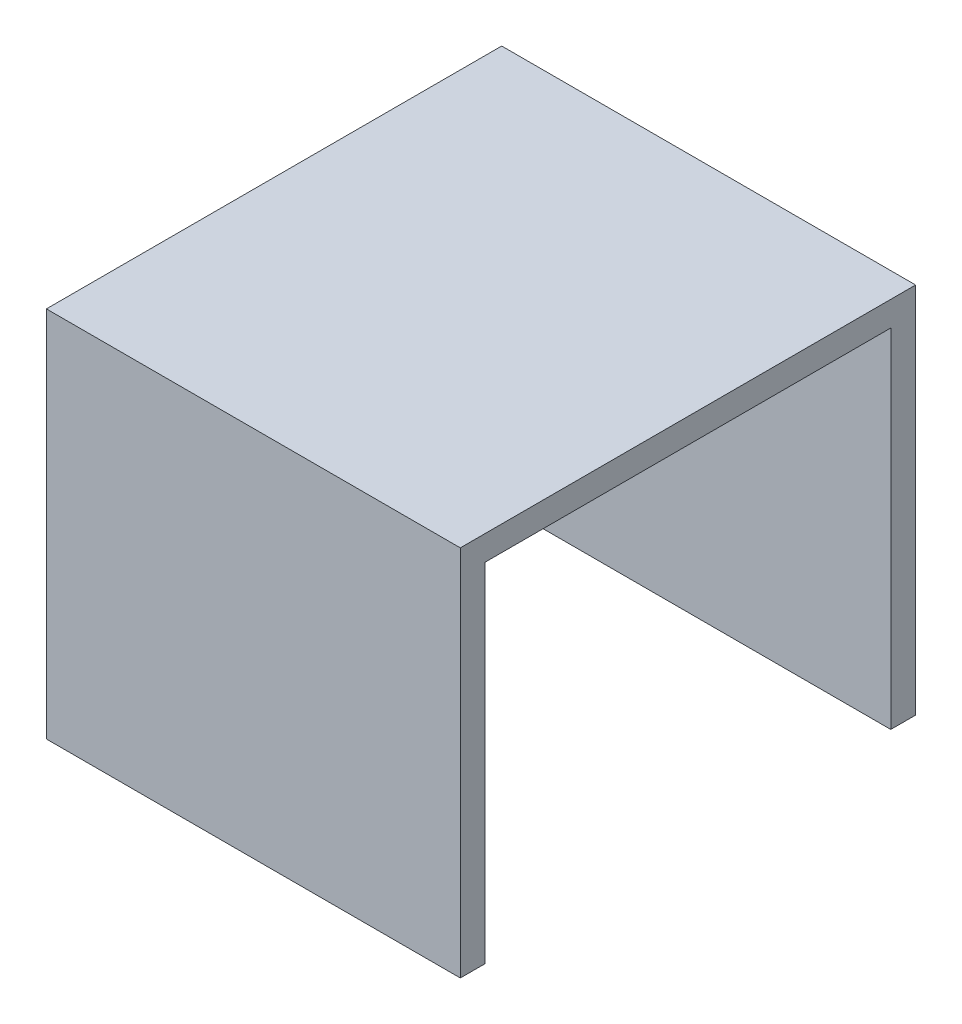
ISO-10303-21;
HEADER;
FILE_DESCRIPTION(('STEP AP214'),'2;1');
FILE_NAME('part.step','',(''),(''),'','','');
FILE_SCHEMA(('AUTOMOTIVE_DESIGN { 1 0 10303 214 1 1 1 1 }'));
ENDSEC;
DATA;
#1=APPLICATION_CONTEXT('core data for automotive mechanical design processes');
#2=APPLICATION_PROTOCOL_DEFINITION('international standard','automotive_design',2000,#1);
#3=PRODUCT_CONTEXT('',#1,'mechanical');
#4=PRODUCT('Part','Part','',(#3));
#5=PRODUCT_RELATED_PRODUCT_CATEGORY('part','',(#4));
#6=PRODUCT_DEFINITION_FORMATION('','',#4);
#7=PRODUCT_DEFINITION_CONTEXT('part definition',#1,'design');
#8=PRODUCT_DEFINITION('design','',#6,#7);
#9=PRODUCT_DEFINITION_SHAPE('','',#8);
#10=(LENGTH_UNIT() NAMED_UNIT(*) SI_UNIT(.MILLI.,.METRE.));
#11=(NAMED_UNIT(*) PLANE_ANGLE_UNIT() SI_UNIT($,.RADIAN.));
#12=(NAMED_UNIT(*) SI_UNIT($,.STERADIAN.) SOLID_ANGLE_UNIT());
#13=UNCERTAINTY_MEASURE_WITH_UNIT(LENGTH_MEASURE(1.E-05),#10,'distance_accuracy_value','');
#14=(GEOMETRIC_REPRESENTATION_CONTEXT(3) GLOBAL_UNCERTAINTY_ASSIGNED_CONTEXT((#13)) GLOBAL_UNIT_ASSIGNED_CONTEXT((#10,
#11,#12)) REPRESENTATION_CONTEXT('',''));
#15=CARTESIAN_POINT('',(0.,0.,0.));
#16=DIRECTION('',(0.,0.,1.));
#17=DIRECTION('',(1.,0.,0.));
#18=AXIS2_PLACEMENT_3D('',#15,#16,#17);
#19=CARTESIAN_POINT('',(1.95,1.695,0.));
#20=DIRECTION('',(0.,1.,0.));
#21=DIRECTION('',(0.707106781186548,0.,0.707106781186548));
#22=AXIS2_PLACEMENT_3D('',#19,#20,#21);
#23=PLANE('',#22);
#24=DIRECTION('',(-1.,0.,0.));
#25=VECTOR('',#24,1.);
#26=CARTESIAN_POINT('',(1.95,1.695,0.03));
#27=LINE('',#26,#25);
#28=CARTESIAN_POINT('',(1.95,1.695,0.03));
#29=VERTEX_POINT('',#28);
#30=CARTESIAN_POINT('',(1.45,1.695,0.03));
#31=VERTEX_POINT('',#30);
#32=EDGE_CURVE('E34',#29,#31,#27,.T.);
#33=ORIENTED_EDGE('',*,*,#32,.F.);
#34=DIRECTION('',(0.,0.,1.));
#35=VECTOR('',#34,1.);
#36=CARTESIAN_POINT('',(1.95,1.695,0.03));
#37=LINE('',#36,#35);
#38=CARTESIAN_POINT('',(1.95,1.695,0.52));
#39=VERTEX_POINT('',#38);
#40=EDGE_CURVE('E11',#29,#39,#37,.T.);
#41=ORIENTED_EDGE('',*,*,#40,.T.);
#42=DIRECTION('',(-1.,0.,0.));
#43=VECTOR('',#42,1.);
#44=CARTESIAN_POINT('',(1.95,1.695,0.52));
#45=LINE('',#44,#43);
#46=CARTESIAN_POINT('',(1.45,1.695,0.52));
#47=VERTEX_POINT('',#46);
#48=EDGE_CURVE('E26',#39,#47,#45,.T.);
#49=ORIENTED_EDGE('',*,*,#48,.T.);
#50=DIRECTION('',(0.,0.,1.));
#51=VECTOR('',#50,1.);
#52=CARTESIAN_POINT('',(1.45,1.695,0.03));
#53=LINE('',#52,#51);
#54=EDGE_CURVE('E124',#31,#47,#53,.T.);
#55=ORIENTED_EDGE('',*,*,#54,.F.);
#56=EDGE_LOOP('',(#33,#41,#49,#55));
#57=FACE_BOUND('',#56,.T.);
#58=ADVANCED_FACE('F16',(#57),#23,.F.);
#59=CARTESIAN_POINT('',(1.6,0.,0.03));
#60=DIRECTION('',(0.,0.,1.));
#61=DIRECTION('',(0.707106781186548,0.707106781186548,0.));
#62=AXIS2_PLACEMENT_3D('',#59,#60,#61);
#63=PLANE('',#62);
#64=DIRECTION('',(0.,1.,0.));
#65=VECTOR('',#64,1.);
#66=CARTESIAN_POINT('',(1.95,1.275,0.03));
#67=LINE('',#66,#65);
#68=CARTESIAN_POINT('',(1.95,1.275,0.03));
#69=VERTEX_POINT('',#68);
#70=EDGE_CURVE('E141',#69,#29,#67,.T.);
#71=ORIENTED_EDGE('',*,*,#70,.T.);
#72=ORIENTED_EDGE('',*,*,#32,.T.);
#73=DIRECTION('',(0.,-1.,0.));
#74=VECTOR('',#73,1.);
#75=CARTESIAN_POINT('',(1.45,1.695,0.03));
#76=LINE('',#75,#74);
#77=CARTESIAN_POINT('',(1.45,1.275,0.03));
#78=VERTEX_POINT('',#77);
#79=EDGE_CURVE('E139',#31,#78,#76,.T.);
#80=ORIENTED_EDGE('',*,*,#79,.T.);
#81=DIRECTION('',(1.,0.,0.));
#82=VECTOR('',#81,1.);
#83=CARTESIAN_POINT('',(1.45,1.275,0.03));
#84=LINE('',#83,#82);
#85=EDGE_CURVE('E89',#78,#69,#84,.T.);
#86=ORIENTED_EDGE('',*,*,#85,.T.);
#87=EDGE_LOOP('',(#71,#72,#80,#86));
#88=FACE_BOUND('',#87,.T.);
#89=ADVANCED_FACE('F148',(#88),#63,.T.);
#90=CARTESIAN_POINT('',(1.95,1.275,0.));
#91=DIRECTION('',(1.,0.,0.));
#92=DIRECTION('',(0.,0.707106781186548,0.707106781186548));
#93=AXIS2_PLACEMENT_3D('',#90,#91,#92);
#94=PLANE('',#93);
#95=ORIENTED_EDGE('',*,*,#70,.F.);
#96=DIRECTION('',(0.,0.,1.));
#97=VECTOR('',#96,1.);
#98=CARTESIAN_POINT('',(1.95,1.275,0.));
#99=LINE('',#98,#97);
#100=CARTESIAN_POINT('',(1.95,1.275,0.));
#101=VERTEX_POINT('',#100);
#102=EDGE_CURVE('E104',#101,#69,#99,.T.);
#103=ORIENTED_EDGE('',*,*,#102,.F.);
#104=DIRECTION('',(0.,1.,0.));
#105=VECTOR('',#104,1.);
#106=CARTESIAN_POINT('',(1.95,1.275,0.));
#107=LINE('',#106,#105);
#108=CARTESIAN_POINT('',(1.95,1.725,0.));
#109=VERTEX_POINT('',#108);
#110=EDGE_CURVE('E103',#101,#109,#107,.T.);
#111=ORIENTED_EDGE('',*,*,#110,.T.);
#112=DIRECTION('',(0.,0.,1.));
#113=VECTOR('',#112,1.);
#114=CARTESIAN_POINT('',(1.95,1.725,0.));
#115=LINE('',#114,#113);
#116=CARTESIAN_POINT('',(1.95,1.725,0.55));
#117=VERTEX_POINT('',#116);
#118=EDGE_CURVE('E132',#109,#117,#115,.T.);
#119=ORIENTED_EDGE('',*,*,#118,.T.);
#120=DIRECTION('',(0.,1.,0.));
#121=VECTOR('',#120,1.);
#122=CARTESIAN_POINT('',(1.95,1.275,0.55));
#123=LINE('',#122,#121);
#124=CARTESIAN_POINT('',(1.95,1.275,0.55));
#125=VERTEX_POINT('',#124);
#126=EDGE_CURVE('E118',#125,#117,#123,.T.);
#127=ORIENTED_EDGE('',*,*,#126,.F.);
#128=DIRECTION('',(0.,0.,1.));
#129=VECTOR('',#128,1.);
#130=CARTESIAN_POINT('',(1.95,1.275,0.52));
#131=LINE('',#130,#129);
#132=CARTESIAN_POINT('',(1.95,1.275,0.52));
#133=VERTEX_POINT('',#132);
#134=EDGE_CURVE('E128',#133,#125,#131,.T.);
#135=ORIENTED_EDGE('',*,*,#134,.F.);
#136=DIRECTION('',(0.,1.,0.));
#137=VECTOR('',#136,1.);
#138=CARTESIAN_POINT('',(1.95,1.275,0.52));
#139=LINE('',#138,#137);
#140=EDGE_CURVE('E129',#133,#39,#139,.T.);
#141=ORIENTED_EDGE('',*,*,#140,.T.);
#142=ORIENTED_EDGE('',*,*,#40,.F.);
#143=EDGE_LOOP('',(#95,#103,#111,#119,#127,#135,#141,#142));
#144=FACE_BOUND('',#143,.T.);
#145=ADVANCED_FACE('F161',(#144),#94,.T.);
#146=CARTESIAN_POINT('',(1.6,0.,0.52));
#147=DIRECTION('',(0.,0.,1.));
#148=DIRECTION('',(0.707106781186548,0.707106781186548,0.));
#149=AXIS2_PLACEMENT_3D('',#146,#147,#148);
#150=PLANE('',#149);
#151=ORIENTED_EDGE('',*,*,#48,.F.);
#152=ORIENTED_EDGE('',*,*,#140,.F.);
#153=DIRECTION('',(1.,0.,0.));
#154=VECTOR('',#153,1.);
#155=CARTESIAN_POINT('',(1.45,1.275,0.52));
#156=LINE('',#155,#154);
#157=CARTESIAN_POINT('',(1.45,1.275,0.52));
#158=VERTEX_POINT('',#157);
#159=EDGE_CURVE('E125',#158,#133,#156,.T.);
#160=ORIENTED_EDGE('',*,*,#159,.F.);
#161=DIRECTION('',(0.,-1.,0.));
#162=VECTOR('',#161,1.);
#163=CARTESIAN_POINT('',(1.45,1.695,0.52));
#164=LINE('',#163,#162);
#165=EDGE_CURVE('E121',#47,#158,#164,.T.);
#166=ORIENTED_EDGE('',*,*,#165,.F.);
#167=EDGE_LOOP('',(#151,#152,#160,#166));
#168=FACE_BOUND('',#167,.T.);
#169=ADVANCED_FACE('F154',(#168),#150,.F.);
#170=CARTESIAN_POINT('',(1.45,1.725,0.));
#171=DIRECTION('',(-1.,0.,0.));
#172=DIRECTION('',(0.,0.707106781186548,0.707106781186548));
#173=AXIS2_PLACEMENT_3D('',#170,#171,#172);
#174=PLANE('',#173);
#175=ORIENTED_EDGE('',*,*,#79,.F.);
#176=ORIENTED_EDGE('',*,*,#54,.T.);
#177=ORIENTED_EDGE('',*,*,#165,.T.);
#178=DIRECTION('',(0.,0.,1.));
#179=VECTOR('',#178,1.);
#180=CARTESIAN_POINT('',(1.45,1.275,0.52));
#181=LINE('',#180,#179);
#182=CARTESIAN_POINT('',(1.45,1.275,0.55));
#183=VERTEX_POINT('',#182);
#184=EDGE_CURVE('E98',#158,#183,#181,.T.);
#185=ORIENTED_EDGE('',*,*,#184,.T.);
#186=DIRECTION('',(0.,-1.,0.));
#187=VECTOR('',#186,1.);
#188=CARTESIAN_POINT('',(1.45,1.725,0.55));
#189=LINE('',#188,#187);
#190=CARTESIAN_POINT('',(1.45,1.725,0.55));
#191=VERTEX_POINT('',#190);
#192=EDGE_CURVE('E111',#191,#183,#189,.T.);
#193=ORIENTED_EDGE('',*,*,#192,.F.);
#194=DIRECTION('',(0.,0.,1.));
#195=VECTOR('',#194,1.);
#196=CARTESIAN_POINT('',(1.45,1.725,0.));
#197=LINE('',#196,#195);
#198=CARTESIAN_POINT('',(1.45,1.725,0.));
#199=VERTEX_POINT('',#198);
#200=EDGE_CURVE('E78',#199,#191,#197,.T.);
#201=ORIENTED_EDGE('',*,*,#200,.F.);
#202=DIRECTION('',(0.,-1.,0.));
#203=VECTOR('',#202,1.);
#204=CARTESIAN_POINT('',(1.45,1.725,0.));
#205=LINE('',#204,#203);
#206=CARTESIAN_POINT('',(1.45,1.275,0.));
#207=VERTEX_POINT('',#206);
#208=EDGE_CURVE('E92',#199,#207,#205,.T.);
#209=ORIENTED_EDGE('',*,*,#208,.T.);
#210=DIRECTION('',(0.,0.,1.));
#211=VECTOR('',#210,1.);
#212=CARTESIAN_POINT('',(1.45,1.275,0.));
#213=LINE('',#212,#211);
#214=EDGE_CURVE('E84',#207,#78,#213,.T.);
#215=ORIENTED_EDGE('',*,*,#214,.T.);
#216=EDGE_LOOP('',(#175,#176,#177,#185,#193,#201,#209,#215));
#217=FACE_BOUND('',#216,.T.);
#218=ADVANCED_FACE('F94',(#217),#174,.T.);
#219=CARTESIAN_POINT('',(1.45,1.275,0.));
#220=DIRECTION('',(0.,-1.,0.));
#221=DIRECTION('',(0.707106781186548,0.,0.707106781186548));
#222=AXIS2_PLACEMENT_3D('',#219,#220,#221);
#223=PLANE('',#222);
#224=ORIENTED_EDGE('',*,*,#85,.F.);
#225=ORIENTED_EDGE('',*,*,#214,.F.);
#226=DIRECTION('',(1.,0.,0.));
#227=VECTOR('',#226,1.);
#228=CARTESIAN_POINT('',(1.45,1.275,0.));
#229=LINE('',#228,#227);
#230=EDGE_CURVE('E88',#207,#101,#229,.T.);
#231=ORIENTED_EDGE('',*,*,#230,.T.);
#232=ORIENTED_EDGE('',*,*,#102,.T.);
#233=EDGE_LOOP('',(#224,#225,#231,#232));
#234=FACE_BOUND('',#233,.T.);
#235=ADVANCED_FACE('F85',(#234),#223,.T.);
#236=CARTESIAN_POINT('',(1.6,0.,0.));
#237=DIRECTION('',(0.,0.,1.));
#238=DIRECTION('',(0.707106781186548,0.707106781186548,0.));
#239=AXIS2_PLACEMENT_3D('',#236,#237,#238);
#240=PLANE('',#239);
#241=ORIENTED_EDGE('',*,*,#110,.F.);
#242=ORIENTED_EDGE('',*,*,#230,.F.);
#243=ORIENTED_EDGE('',*,*,#208,.F.);
#244=DIRECTION('',(-1.,0.,0.));
#245=VECTOR('',#244,1.);
#246=CARTESIAN_POINT('',(1.95,1.725,0.));
#247=LINE('',#246,#245);
#248=EDGE_CURVE('E106',#109,#199,#247,.T.);
#249=ORIENTED_EDGE('',*,*,#248,.F.);
#250=EDGE_LOOP('',(#241,#242,#243,#249));
#251=FACE_BOUND('',#250,.T.);
#252=ADVANCED_FACE('F101',(#251),#240,.F.);
#253=CARTESIAN_POINT('',(1.95,1.725,0.));
#254=DIRECTION('',(0.,1.,0.));
#255=DIRECTION('',(0.707106781186548,0.,0.707106781186548));
#256=AXIS2_PLACEMENT_3D('',#253,#254,#255);
#257=PLANE('',#256);
#258=ORIENTED_EDGE('',*,*,#248,.T.);
#259=ORIENTED_EDGE('',*,*,#200,.T.);
#260=DIRECTION('',(-1.,0.,0.));
#261=VECTOR('',#260,1.);
#262=CARTESIAN_POINT('',(1.95,1.725,0.55));
#263=LINE('',#262,#261);
#264=EDGE_CURVE('E109',#117,#191,#263,.T.);
#265=ORIENTED_EDGE('',*,*,#264,.F.);
#266=ORIENTED_EDGE('',*,*,#118,.F.);
#267=EDGE_LOOP('',(#258,#259,#265,#266));
#268=FACE_BOUND('',#267,.T.);
#269=ADVANCED_FACE('F159',(#268),#257,.T.);
#270=CARTESIAN_POINT('',(1.6,0.,0.55));
#271=DIRECTION('',(0.,0.,1.));
#272=DIRECTION('',(0.707106781186548,0.707106781186548,0.));
#273=AXIS2_PLACEMENT_3D('',#270,#271,#272);
#274=PLANE('',#273);
#275=ORIENTED_EDGE('',*,*,#264,.T.);
#276=ORIENTED_EDGE('',*,*,#192,.T.);
#277=DIRECTION('',(1.,0.,0.));
#278=VECTOR('',#277,1.);
#279=CARTESIAN_POINT('',(1.45,1.275,0.55));
#280=LINE('',#279,#278);
#281=EDGE_CURVE('E20',#183,#125,#280,.T.);
#282=ORIENTED_EDGE('',*,*,#281,.T.);
#283=ORIENTED_EDGE('',*,*,#126,.T.);
#284=EDGE_LOOP('',(#275,#276,#282,#283));
#285=FACE_BOUND('',#284,.T.);
#286=ADVANCED_FACE('F162',(#285),#274,.T.);
#287=CARTESIAN_POINT('',(1.45,1.275,0.));
#288=DIRECTION('',(0.,-1.,0.));
#289=DIRECTION('',(0.707106781186548,0.,0.707106781186548));
#290=AXIS2_PLACEMENT_3D('',#287,#288,#289);
#291=PLANE('',#290);
#292=ORIENTED_EDGE('',*,*,#159,.T.);
#293=ORIENTED_EDGE('',*,*,#134,.T.);
#294=ORIENTED_EDGE('',*,*,#281,.F.);
#295=ORIENTED_EDGE('',*,*,#184,.F.);
#296=EDGE_LOOP('',(#292,#293,#294,#295));
#297=FACE_BOUND('',#296,.T.);
#298=ADVANCED_FACE('F18',(#297),#291,.T.);
#299=CLOSED_SHELL('',(#58,#89,#145,#169,#218,#235,#252,#269,#286,#298));
#300=MANIFOLD_SOLID_BREP('B1',#299);
#301=ADVANCED_BREP_SHAPE_REPRESENTATION('',(#18,#300),#14);
#302=SHAPE_DEFINITION_REPRESENTATION(#9,#301);
ENDSEC;
END-ISO-10303-21;
